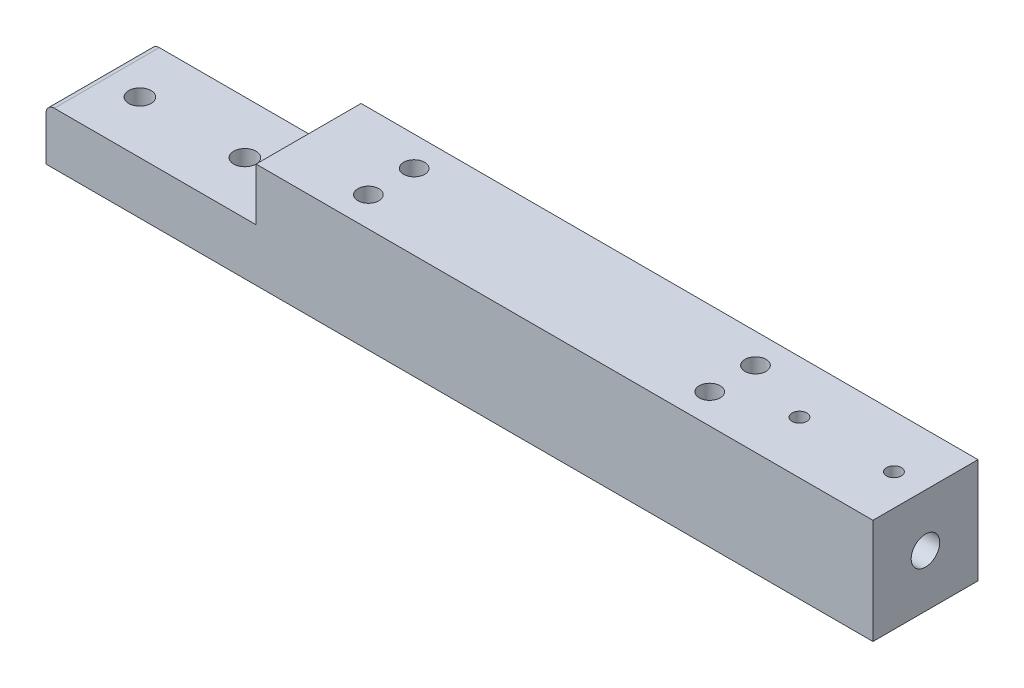
ISO-10303-21;
HEADER;
FILE_DESCRIPTION(('STEP AP214'),'2;1');
FILE_NAME('part.step','',(''),(''),'','','');
FILE_SCHEMA(('AUTOMOTIVE_DESIGN { 1 0 10303 214 1 1 1 1 }'));
ENDSEC;
DATA;
#1=APPLICATION_CONTEXT('core data for automotive mechanical design processes');
#2=APPLICATION_PROTOCOL_DEFINITION('international standard','automotive_design',2000,#1);
#3=PRODUCT_CONTEXT('',#1,'mechanical');
#4=PRODUCT('Part','Part','',(#3));
#5=PRODUCT_RELATED_PRODUCT_CATEGORY('part','',(#4));
#6=PRODUCT_DEFINITION_FORMATION('','',#4);
#7=PRODUCT_DEFINITION_CONTEXT('part definition',#1,'design');
#8=PRODUCT_DEFINITION('design','',#6,#7);
#9=PRODUCT_DEFINITION_SHAPE('','',#8);
#10=(LENGTH_UNIT() NAMED_UNIT(*) SI_UNIT(.MILLI.,.METRE.));
#11=(NAMED_UNIT(*) PLANE_ANGLE_UNIT() SI_UNIT($,.RADIAN.));
#12=(NAMED_UNIT(*) SI_UNIT($,.STERADIAN.) SOLID_ANGLE_UNIT());
#13=UNCERTAINTY_MEASURE_WITH_UNIT(LENGTH_MEASURE(1.E-05),#10,'distance_accuracy_value','');
#14=(GEOMETRIC_REPRESENTATION_CONTEXT(3) GLOBAL_UNCERTAINTY_ASSIGNED_CONTEXT((#13)) GLOBAL_UNIT_ASSIGNED_CONTEXT((#10,
#11,#12)) REPRESENTATION_CONTEXT('',''));
#15=CARTESIAN_POINT('',(0.,0.,0.));
#16=DIRECTION('',(0.,0.,1.));
#17=DIRECTION('',(1.,0.,0.));
#18=AXIS2_PLACEMENT_3D('',#15,#16,#17);
#19=CARTESIAN_POINT('',(0.,6.35000000000002,6.35));
#20=DIRECTION('',(1.,0.,0.));
#21=DIRECTION('',(0.,1.,0.));
#22=AXIS2_PLACEMENT_3D('',#19,#20,#21);
#23=PLANE('',#22);
#24=DIRECTION('',(0.,-1.,0.));
#25=VECTOR('',#24,1.);
#26=CARTESIAN_POINT('',(0.,6.35000000000002,6.35));
#27=LINE('',#26,#25);
#28=CARTESIAN_POINT('',(0.,-1.,6.35));
#29=VERTEX_POINT('',#28);
#30=CARTESIAN_POINT('',(0.,-6.34999999999998,6.35));
#31=VERTEX_POINT('',#30);
#32=EDGE_CURVE('E177',#29,#31,#27,.T.);
#33=ORIENTED_EDGE('',*,*,#32,.F.);
#34=DIRECTION('',(0.,0.,1.));
#35=VECTOR('',#34,1.);
#36=CARTESIAN_POINT('',(0.,-1.,6.35));
#37=LINE('',#36,#35);
#38=CARTESIAN_POINT('',(0.,-1.,-6.35));
#39=VERTEX_POINT('',#38);
#40=EDGE_CURVE('E47',#29,#39,#37,.F.);
#41=ORIENTED_EDGE('',*,*,#40,.T.);
#42=DIRECTION('',(0.,-1.,0.));
#43=VECTOR('',#42,1.);
#44=CARTESIAN_POINT('',(0.,6.35000000000002,-6.35));
#45=LINE('',#44,#43);
#46=CARTESIAN_POINT('',(0.,-6.34999999999998,-6.35));
#47=VERTEX_POINT('',#46);
#48=EDGE_CURVE('E174',#39,#47,#45,.T.);
#49=ORIENTED_EDGE('',*,*,#48,.T.);
#50=DIRECTION('',(0.,0.,-1.));
#51=VECTOR('',#50,1.);
#52=CARTESIAN_POINT('',(0.,-6.34999999999998,6.35));
#53=LINE('',#52,#51);
#54=EDGE_CURVE('E200',#31,#47,#53,.T.);
#55=ORIENTED_EDGE('',*,*,#54,.F.);
#56=EDGE_LOOP('',(#33,#41,#49,#55));
#57=FACE_BOUND('',#56,.T.);
#58=ADVANCED_FACE('F39',(#57),#23,.F.);
#59=CARTESIAN_POINT('',(0.,-6.34999999999998,6.35));
#60=DIRECTION('',(0.,1.,0.));
#61=DIRECTION('',(-1.,0.,0.));
#62=AXIS2_PLACEMENT_3D('',#59,#60,#61);
#63=PLANE('',#62);
#64=CARTESIAN_POINT('',(35.4,-6.34999999999996,-2.7686));
#65=DIRECTION('',(0.,1.,0.));
#66=DIRECTION('',(0.,0.,1.));
#67=AXIS2_PLACEMENT_3D('',#64,#65,#66);
#68=CIRCLE('',#67,1.26999999999999);
#69=CARTESIAN_POINT('',(35.4,-6.34999999999996,-1.4986));
#70=VERTEX_POINT('',#69);
#71=EDGE_CURVE('E122',#70,#70,#68,.T.);
#72=ORIENTED_EDGE('',*,*,#71,.T.);
#73=EDGE_LOOP('',(#72));
#74=FACE_BOUND('',#73,.T.);
#75=CARTESIAN_POINT('',(76.675,-6.34999999999994,-2.7686));
#76=DIRECTION('',(0.,1.,0.));
#77=DIRECTION('',(0.,0.,1.));
#78=AXIS2_PLACEMENT_3D('',#75,#76,#77);
#79=CIRCLE('',#78,1.26999999999999);
#80=CARTESIAN_POINT('',(76.675,-6.34999999999994,-1.49860000000001));
#81=VERTEX_POINT('',#80);
#82=EDGE_CURVE('E128',#81,#81,#79,.T.);
#83=ORIENTED_EDGE('',*,*,#82,.T.);
#84=EDGE_LOOP('',(#83));
#85=FACE_BOUND('',#84,.T.);
#86=CARTESIAN_POINT('',(76.675,-6.34999999999994,2.76859999999999));
#87=DIRECTION('',(0.,1.,0.));
#88=DIRECTION('',(0.,0.,1.));
#89=AXIS2_PLACEMENT_3D('',#86,#87,#88);
#90=CIRCLE('',#89,1.26999999999999);
#91=CARTESIAN_POINT('',(76.675,-6.34999999999994,4.03859999999998));
#92=VERTEX_POINT('',#91);
#93=EDGE_CURVE('E134',#92,#92,#90,.T.);
#94=ORIENTED_EDGE('',*,*,#93,.T.);
#95=EDGE_LOOP('',(#94));
#96=FACE_BOUND('',#95,.T.);
#97=CARTESIAN_POINT('',(35.4,-6.34999999999996,2.76859999999999));
#98=DIRECTION('',(0.,1.,0.));
#99=DIRECTION('',(0.,0.,1.));
#100=AXIS2_PLACEMENT_3D('',#97,#98,#99);
#101=CIRCLE('',#100,1.26999999999999);
#102=CARTESIAN_POINT('',(35.4,-6.34999999999996,4.03859999999998));
#103=VERTEX_POINT('',#102);
#104=EDGE_CURVE('E140',#103,#103,#101,.T.);
#105=ORIENTED_EDGE('',*,*,#104,.T.);
#106=EDGE_LOOP('',(#105));
#107=FACE_BOUND('',#106,.T.);
#108=CARTESIAN_POINT('',(17.7000000000005,-6.34999999999998,-5.11919416561077E-13));
#109=DIRECTION('',(0.,1.,0.));
#110=DIRECTION('',(0.,0.,1.));
#111=AXIS2_PLACEMENT_3D('',#108,#109,#110);
#112=CIRCLE('',#111,1.35255);
#113=CARTESIAN_POINT('',(17.7000000000005,-6.34999999999998,1.35254999999949));
#114=VERTEX_POINT('',#113);
#115=EDGE_CURVE('E152',#114,#114,#112,.T.);
#116=ORIENTED_EDGE('',*,*,#115,.T.);
#117=EDGE_LOOP('',(#116));
#118=FACE_BOUND('',#117,.T.);
#119=CARTESIAN_POINT('',(5.00000000000052,-6.34999999999998,-5.11919416561077E-13));
#120=DIRECTION('',(0.,1.,0.));
#121=DIRECTION('',(0.,0.,1.));
#122=AXIS2_PLACEMENT_3D('',#119,#120,#121);
#123=CIRCLE('',#122,1.35255);
#124=CARTESIAN_POINT('',(5.00000000000052,-6.34999999999998,1.35254999999949));
#125=VERTEX_POINT('',#124);
#126=EDGE_CURVE('E158',#125,#125,#123,.T.);
#127=ORIENTED_EDGE('',*,*,#126,.T.);
#128=EDGE_LOOP('',(#127));
#129=FACE_BOUND('',#128,.T.);
#130=DIRECTION('',(1.,0.,0.));
#131=VECTOR('',#130,1.);
#132=CARTESIAN_POINT('',(0.,-6.34999999999998,-6.35));
#133=LINE('',#132,#131);
#134=CARTESIAN_POINT('',(100.,-6.35,-6.35));
#135=VERTEX_POINT('',#134);
#136=EDGE_CURVE('E189',#47,#135,#133,.T.);
#137=ORIENTED_EDGE('',*,*,#136,.T.);
#138=DIRECTION('',(0.,0.,-1.));
#139=VECTOR('',#138,1.);
#140=CARTESIAN_POINT('',(100.,-6.35,6.35));
#141=LINE('',#140,#139);
#142=CARTESIAN_POINT('',(100.,-6.35,6.35));
#143=VERTEX_POINT('',#142);
#144=EDGE_CURVE('E197',#143,#135,#141,.T.);
#145=ORIENTED_EDGE('',*,*,#144,.F.);
#146=DIRECTION('',(1.,0.,0.));
#147=VECTOR('',#146,1.);
#148=CARTESIAN_POINT('',(0.,-6.34999999999998,6.35));
#149=LINE('',#148,#147);
#150=EDGE_CURVE('E179',#31,#143,#149,.T.);
#151=ORIENTED_EDGE('',*,*,#150,.F.);
#152=ORIENTED_EDGE('',*,*,#54,.T.);
#153=EDGE_LOOP('',(#137,#145,#151,#152));
#154=FACE_BOUND('',#153,.T.);
#155=ADVANCED_FACE('F243',(#74,#85,#96,#107,#118,#129,#154),#63,.F.);
#156=CARTESIAN_POINT('',(100.,6.35000000000006,6.35));
#157=DIRECTION('',(-1.,0.,0.));
#158=DIRECTION('',(0.,0.,1.));
#159=AXIS2_PLACEMENT_3D('',#156,#157,#158);
#160=PLANE('',#159);
#161=CARTESIAN_POINT('',(100.,0.,0.));
#162=DIRECTION('',(1.,0.,0.));
#163=DIRECTION('',(0.,0.,-1.));
#164=AXIS2_PLACEMENT_3D('',#161,#162,#163);
#165=CIRCLE('',#164,1.7272);
#166=CARTESIAN_POINT('',(100.,0.,-1.7272));
#167=VERTEX_POINT('',#166);
#168=EDGE_CURVE('E143',#167,#167,#165,.T.);
#169=ORIENTED_EDGE('',*,*,#168,.F.);
#170=EDGE_LOOP('',(#169));
#171=FACE_BOUND('',#170,.T.);
#172=DIRECTION('',(0.,1.,0.));
#173=VECTOR('',#172,1.);
#174=CARTESIAN_POINT('',(100.,6.35000000000006,-6.35));
#175=LINE('',#174,#173);
#176=CARTESIAN_POINT('',(100.,6.35000000000006,-6.35));
#177=VERTEX_POINT('',#176);
#178=EDGE_CURVE('E191',#135,#177,#175,.T.);
#179=ORIENTED_EDGE('',*,*,#178,.T.);
#180=DIRECTION('',(0.,0.,-1.));
#181=VECTOR('',#180,1.);
#182=CARTESIAN_POINT('',(100.,6.35000000000006,6.35));
#183=LINE('',#182,#181);
#184=CARTESIAN_POINT('',(100.,6.35000000000006,6.35));
#185=VERTEX_POINT('',#184);
#186=EDGE_CURVE('E187',#185,#177,#183,.T.);
#187=ORIENTED_EDGE('',*,*,#186,.F.);
#188=DIRECTION('',(0.,1.,0.));
#189=VECTOR('',#188,1.);
#190=CARTESIAN_POINT('',(100.,6.35000000000006,6.35));
#191=LINE('',#190,#189);
#192=EDGE_CURVE('E182',#143,#185,#191,.T.);
#193=ORIENTED_EDGE('',*,*,#192,.F.);
#194=ORIENTED_EDGE('',*,*,#144,.T.);
#195=EDGE_LOOP('',(#179,#187,#193,#194));
#196=FACE_BOUND('',#195,.T.);
#197=ADVANCED_FACE('F247',(#171,#196),#160,.F.);
#198=CARTESIAN_POINT('',(0.,6.35000000000002,6.35));
#199=DIRECTION('',(0.,-1.,0.));
#200=DIRECTION('',(1.,0.,0.));
#201=AXIS2_PLACEMENT_3D('',#198,#199,#200);
#202=PLANE('',#201);
#203=CARTESIAN_POINT('',(84.76,6.35000000000006,0.));
#204=DIRECTION('',(0.,1.,0.));
#205=DIRECTION('',(0.,0.,1.));
#206=AXIS2_PLACEMENT_3D('',#203,#204,#205);
#207=CIRCLE('',#206,0.888999999999987);
#208=CARTESIAN_POINT('',(84.76,6.35000000000006,0.888999999999987));
#209=VERTEX_POINT('',#208);
#210=EDGE_CURVE('E111',#209,#209,#207,.T.);
#211=ORIENTED_EDGE('',*,*,#210,.F.);
#212=EDGE_LOOP('',(#211));
#213=FACE_BOUND('',#212,.T.);
#214=CARTESIAN_POINT('',(96.19,6.35000000000006,0.));
#215=DIRECTION('',(0.,1.,0.));
#216=DIRECTION('',(0.,0.,1.));
#217=AXIS2_PLACEMENT_3D('',#214,#215,#216);
#218=CIRCLE('',#217,0.888999999999987);
#219=CARTESIAN_POINT('',(96.19,6.35000000000006,0.888999999999987));
#220=VERTEX_POINT('',#219);
#221=EDGE_CURVE('E110',#220,#220,#218,.T.);
#222=ORIENTED_EDGE('',*,*,#221,.F.);
#223=EDGE_LOOP('',(#222));
#224=FACE_BOUND('',#223,.T.);
#225=CARTESIAN_POINT('',(35.4,6.35000000000004,-2.7686));
#226=DIRECTION('',(0.,1.,0.));
#227=DIRECTION('',(0.,0.,1.));
#228=AXIS2_PLACEMENT_3D('',#225,#226,#227);
#229=CIRCLE('',#228,1.27);
#230=CARTESIAN_POINT('',(35.4,6.35000000000004,-1.4986));
#231=VERTEX_POINT('',#230);
#232=EDGE_CURVE('E119',#231,#231,#229,.T.);
#233=ORIENTED_EDGE('',*,*,#232,.F.);
#234=EDGE_LOOP('',(#233));
#235=FACE_BOUND('',#234,.T.);
#236=CARTESIAN_POINT('',(76.675,6.35000000000006,-2.7686));
#237=DIRECTION('',(0.,1.,0.));
#238=DIRECTION('',(0.,0.,1.));
#239=AXIS2_PLACEMENT_3D('',#236,#237,#238);
#240=CIRCLE('',#239,1.26999999999999);
#241=CARTESIAN_POINT('',(76.675,6.35000000000006,-1.49860000000001));
#242=VERTEX_POINT('',#241);
#243=EDGE_CURVE('E125',#242,#242,#240,.T.);
#244=ORIENTED_EDGE('',*,*,#243,.F.);
#245=EDGE_LOOP('',(#244));
#246=FACE_BOUND('',#245,.T.);
#247=CARTESIAN_POINT('',(76.675,6.35000000000006,2.76859999999999));
#248=DIRECTION('',(0.,1.,0.));
#249=DIRECTION('',(0.,0.,1.));
#250=AXIS2_PLACEMENT_3D('',#247,#248,#249);
#251=CIRCLE('',#250,1.26999999999999);
#252=CARTESIAN_POINT('',(76.675,6.35000000000006,4.03859999999998));
#253=VERTEX_POINT('',#252);
#254=EDGE_CURVE('E131',#253,#253,#251,.T.);
#255=ORIENTED_EDGE('',*,*,#254,.F.);
#256=EDGE_LOOP('',(#255));
#257=FACE_BOUND('',#256,.T.);
#258=CARTESIAN_POINT('',(35.4,6.35000000000004,2.76859999999999));
#259=DIRECTION('',(0.,1.,0.));
#260=DIRECTION('',(0.,0.,1.));
#261=AXIS2_PLACEMENT_3D('',#258,#259,#260);
#262=CIRCLE('',#261,1.27);
#263=CARTESIAN_POINT('',(35.4,6.35000000000004,4.03859999999999));
#264=VERTEX_POINT('',#263);
#265=EDGE_CURVE('E137',#264,#264,#262,.T.);
#266=ORIENTED_EDGE('',*,*,#265,.F.);
#267=EDGE_LOOP('',(#266));
#268=FACE_BOUND('',#267,.T.);
#269=DIRECTION('',(-1.,0.,0.));
#270=VECTOR('',#269,1.);
#271=CARTESIAN_POINT('',(0.,6.35000000000002,-6.35));
#272=LINE('',#271,#270);
#273=CARTESIAN_POINT('',(25.4,6.35000000000002,-6.35));
#274=VERTEX_POINT('',#273);
#275=EDGE_CURVE('E180',#177,#274,#272,.T.);
#276=ORIENTED_EDGE('',*,*,#275,.T.);
#277=DIRECTION('',(0.,0.,1.));
#278=VECTOR('',#277,1.);
#279=CARTESIAN_POINT('',(25.4,6.35000000000002,-6.35));
#280=LINE('',#279,#278);
#281=CARTESIAN_POINT('',(25.4,6.35000000000002,6.35));
#282=VERTEX_POINT('',#281);
#283=EDGE_CURVE('E171',#274,#282,#280,.T.);
#284=ORIENTED_EDGE('',*,*,#283,.T.);
#285=DIRECTION('',(-1.,0.,0.));
#286=VECTOR('',#285,1.);
#287=CARTESIAN_POINT('',(0.,6.35000000000002,6.35));
#288=LINE('',#287,#286);
#289=EDGE_CURVE('E184',#185,#282,#288,.T.);
#290=ORIENTED_EDGE('',*,*,#289,.F.);
#291=ORIENTED_EDGE('',*,*,#186,.T.);
#292=EDGE_LOOP('',(#276,#284,#290,#291));
#293=FACE_BOUND('',#292,.T.);
#294=ADVANCED_FACE('F253',(#213,#224,#235,#246,#257,#268,#293),#202,.F.);
#295=CARTESIAN_POINT('',(0.,-6.34999999999998,6.35));
#296=DIRECTION('',(0.,0.,1.));
#297=DIRECTION('',(1.,0.,0.));
#298=AXIS2_PLACEMENT_3D('',#295,#296,#297);
#299=PLANE('',#298);
#300=DIRECTION('',(1.,0.,0.));
#301=VECTOR('',#300,1.);
#302=CARTESIAN_POINT('',(0.,0.,6.35));
#303=LINE('',#302,#301);
#304=CARTESIAN_POINT('',(0.999999999999997,0.,6.35));
#305=VERTEX_POINT('',#304);
#306=CARTESIAN_POINT('',(25.4,0.,6.35));
#307=VERTEX_POINT('',#306);
#308=EDGE_CURVE('E161',#305,#307,#303,.T.);
#309=ORIENTED_EDGE('',*,*,#308,.F.);
#310=CARTESIAN_POINT('',(0.999999999999997,-1.,6.35));
#311=DIRECTION('',(0.,0.,1.));
#312=DIRECTION('',(1.,0.,0.));
#313=AXIS2_PLACEMENT_3D('',#310,#311,#312);
#314=CIRCLE('',#313,1.);
#315=EDGE_CURVE('E61',#305,#29,#314,.T.);
#316=ORIENTED_EDGE('',*,*,#315,.T.);
#317=ORIENTED_EDGE('',*,*,#32,.T.);
#318=ORIENTED_EDGE('',*,*,#150,.T.);
#319=ORIENTED_EDGE('',*,*,#192,.T.);
#320=ORIENTED_EDGE('',*,*,#289,.T.);
#321=DIRECTION('',(0.,1.,0.));
#322=VECTOR('',#321,1.);
#323=CARTESIAN_POINT('',(25.4,6.35000000000002,6.35));
#324=LINE('',#323,#322);
#325=EDGE_CURVE('E165',#307,#282,#324,.T.);
#326=ORIENTED_EDGE('',*,*,#325,.F.);
#327=EDGE_LOOP('',(#309,#316,#317,#318,#319,#320,#326));
#328=FACE_BOUND('',#327,.T.);
#329=ADVANCED_FACE('F257',(#328),#299,.T.);
#330=CARTESIAN_POINT('',(0.,-6.34999999999998,-6.35));
#331=DIRECTION('',(0.,0.,1.));
#332=DIRECTION('',(1.,0.,0.));
#333=AXIS2_PLACEMENT_3D('',#330,#331,#332);
#334=PLANE('',#333);
#335=ORIENTED_EDGE('',*,*,#48,.F.);
#336=CARTESIAN_POINT('',(0.999999999999997,-1.,-6.35));
#337=DIRECTION('',(0.,0.,1.));
#338=DIRECTION('',(1.,0.,0.));
#339=AXIS2_PLACEMENT_3D('',#336,#337,#338);
#340=CIRCLE('',#339,1.);
#341=CARTESIAN_POINT('',(0.999999999999997,0.,-6.35));
#342=VERTEX_POINT('',#341);
#343=EDGE_CURVE('E11',#39,#342,#340,.F.);
#344=ORIENTED_EDGE('',*,*,#343,.T.);
#345=DIRECTION('',(1.,0.,0.));
#346=VECTOR('',#345,1.);
#347=CARTESIAN_POINT('',(0.,0.,-6.35));
#348=LINE('',#347,#346);
#349=CARTESIAN_POINT('',(25.4,0.,-6.35));
#350=VERTEX_POINT('',#349);
#351=EDGE_CURVE('E162',#342,#350,#348,.T.);
#352=ORIENTED_EDGE('',*,*,#351,.T.);
#353=DIRECTION('',(0.,1.,0.));
#354=VECTOR('',#353,1.);
#355=CARTESIAN_POINT('',(25.4,6.35000000000002,-6.35));
#356=LINE('',#355,#354);
#357=EDGE_CURVE('E164',#350,#274,#356,.T.);
#358=ORIENTED_EDGE('',*,*,#357,.T.);
#359=ORIENTED_EDGE('',*,*,#275,.F.);
#360=ORIENTED_EDGE('',*,*,#178,.F.);
#361=ORIENTED_EDGE('',*,*,#136,.F.);
#362=EDGE_LOOP('',(#335,#344,#352,#358,#359,#360,#361));
#363=FACE_BOUND('',#362,.T.);
#364=ADVANCED_FACE('F259',(#363),#334,.F.);
#365=CARTESIAN_POINT('',(25.4,6.35000000000002,-6.35));
#366=DIRECTION('',(1.,0.,0.));
#367=DIRECTION('',(0.,0.,-1.));
#368=AXIS2_PLACEMENT_3D('',#365,#366,#367);
#369=PLANE('',#368);
#370=ORIENTED_EDGE('',*,*,#325,.T.);
#371=ORIENTED_EDGE('',*,*,#283,.F.);
#372=ORIENTED_EDGE('',*,*,#357,.F.);
#373=DIRECTION('',(0.,0.,1.));
#374=VECTOR('',#373,1.);
#375=CARTESIAN_POINT('',(25.4,0.,-6.35));
#376=LINE('',#375,#374);
#377=EDGE_CURVE('E168',#350,#307,#376,.T.);
#378=ORIENTED_EDGE('',*,*,#377,.T.);
#379=EDGE_LOOP('',(#370,#371,#372,#378));
#380=FACE_BOUND('',#379,.T.);
#381=ADVANCED_FACE('F262',(#380),#369,.F.);
#382=CARTESIAN_POINT('',(0.,0.,-6.35));
#383=DIRECTION('',(0.,-1.,0.));
#384=DIRECTION('',(1.,0.,0.));
#385=AXIS2_PLACEMENT_3D('',#382,#383,#384);
#386=PLANE('',#385);
#387=CARTESIAN_POINT('',(17.7000000000005,0.,-5.11919416561077E-13));
#388=DIRECTION('',(0.,1.,0.));
#389=DIRECTION('',(0.,0.,1.));
#390=AXIS2_PLACEMENT_3D('',#387,#388,#389);
#391=CIRCLE('',#390,1.35254999999999);
#392=CARTESIAN_POINT('',(17.7000000000005,0.,1.35254999999948));
#393=VERTEX_POINT('',#392);
#394=EDGE_CURVE('E149',#393,#393,#391,.T.);
#395=ORIENTED_EDGE('',*,*,#394,.F.);
#396=EDGE_LOOP('',(#395));
#397=FACE_BOUND('',#396,.T.);
#398=CARTESIAN_POINT('',(5.00000000000052,0.,-5.11919416561077E-13));
#399=DIRECTION('',(0.,1.,0.));
#400=DIRECTION('',(0.,0.,1.));
#401=AXIS2_PLACEMENT_3D('',#398,#399,#400);
#402=CIRCLE('',#401,1.35254999999999);
#403=CARTESIAN_POINT('',(5.00000000000052,0.,1.35254999999948));
#404=VERTEX_POINT('',#403);
#405=EDGE_CURVE('E155',#404,#404,#402,.T.);
#406=ORIENTED_EDGE('',*,*,#405,.F.);
#407=EDGE_LOOP('',(#406));
#408=FACE_BOUND('',#407,.T.);
#409=ORIENTED_EDGE('',*,*,#351,.F.);
#410=DIRECTION('',(0.,0.,1.));
#411=VECTOR('',#410,1.);
#412=CARTESIAN_POINT('',(0.999999999999997,0.,-6.35));
#413=LINE('',#412,#411);
#414=EDGE_CURVE('E203',#342,#305,#413,.T.);
#415=ORIENTED_EDGE('',*,*,#414,.T.);
#416=ORIENTED_EDGE('',*,*,#308,.T.);
#417=ORIENTED_EDGE('',*,*,#377,.F.);
#418=EDGE_LOOP('',(#409,#415,#416,#417));
#419=FACE_BOUND('',#418,.T.);
#420=ADVANCED_FACE('F266',(#397,#408,#419),#386,.F.);
#421=CARTESIAN_POINT('',(5.00000000000052,0.,-5.11919416561077E-13));
#422=DIRECTION('',(0.,1.,0.));
#423=DIRECTION('',(0.,0.,1.));
#424=AXIS2_PLACEMENT_3D('',#421,#422,#423);
#425=CYLINDRICAL_SURFACE('',#424,1.35254999999999);
#426=ORIENTED_EDGE('',*,*,#126,.F.);
#427=EDGE_LOOP('',(#426));
#428=FACE_BOUND('',#427,.T.);
#429=ORIENTED_EDGE('',*,*,#405,.T.);
#430=EDGE_LOOP('',(#429));
#431=FACE_BOUND('',#430,.T.);
#432=ADVANCED_FACE('F269',(#428,#431),#425,.F.);
#433=CARTESIAN_POINT('',(17.7000000000005,0.,-5.11919416561077E-13));
#434=DIRECTION('',(0.,1.,0.));
#435=DIRECTION('',(0.,0.,1.));
#436=AXIS2_PLACEMENT_3D('',#433,#434,#435);
#437=CYLINDRICAL_SURFACE('',#436,1.35254999999999);
#438=ORIENTED_EDGE('',*,*,#115,.F.);
#439=EDGE_LOOP('',(#438));
#440=FACE_BOUND('',#439,.T.);
#441=ORIENTED_EDGE('',*,*,#394,.T.);
#442=EDGE_LOOP('',(#441));
#443=FACE_BOUND('',#442,.T.);
#444=ADVANCED_FACE('F276',(#440,#443),#437,.F.);
#445=CARTESIAN_POINT('',(90.,0.,0.));
#446=DIRECTION('',(1.,0.,0.));
#447=DIRECTION('',(0.,0.,-1.));
#448=AXIS2_PLACEMENT_3D('',#445,#446,#447);
#449=CONICAL_SURFACE('',#448,1.7272,1.02974425867665);
#450=CARTESIAN_POINT('',(88.9621935388156,0.,0.));
#451=VERTEX_POINT('',#450);
#452=VERTEX_LOOP('',#451);
#453=FACE_BOUND('',#452,.T.);
#454=CARTESIAN_POINT('',(90.,0.,0.));
#455=DIRECTION('',(1.,0.,0.));
#456=DIRECTION('',(0.,0.,-1.));
#457=AXIS2_PLACEMENT_3D('',#454,#455,#456);
#458=CIRCLE('',#457,1.7272);
#459=CARTESIAN_POINT('',(90.,0.,-1.7272));
#460=VERTEX_POINT('',#459);
#461=EDGE_CURVE('E146',#460,#460,#458,.T.);
#462=ORIENTED_EDGE('',*,*,#461,.T.);
#463=EDGE_LOOP('',(#462));
#464=FACE_BOUND('',#463,.T.);
#465=ADVANCED_FACE('F238',(#453,#464),#449,.F.);
#466=CARTESIAN_POINT('',(100.,0.,0.));
#467=DIRECTION('',(1.,0.,0.));
#468=DIRECTION('',(0.,0.,-1.));
#469=AXIS2_PLACEMENT_3D('',#466,#467,#468);
#470=CYLINDRICAL_SURFACE('',#469,1.7272);
#471=CARTESIAN_POINT('',(96.19,1.48084396207032,0.888999999999994));
#472=CARTESIAN_POINT('',(96.2361083535032,1.48084832745726,0.888996615264809));
#473=CARTESIAN_POINT('',(96.2822700180821,1.48303058217222,0.885388613992067));
#474=CARTESIAN_POINT('',(96.3731590282946,1.49143684404558,0.871148568158528));
#475=CARTESIAN_POINT('',(96.4178833552682,1.49766883967234,0.860502639950182));
#476=CARTESIAN_POINT('',(96.504409046111,1.51325732830116,0.832779087205355));
#477=CARTESIAN_POINT('',(96.5462251769757,1.5225963907492,0.815737276558255));
#478=CARTESIAN_POINT('',(96.6263933374121,1.54331937386705,0.775815390304991));
#479=CARTESIAN_POINT('',(96.6647450075166,1.55470350636493,0.752934709806195));
#480=CARTESIAN_POINT('',(96.7406056127217,1.57945187802226,0.69963378151837));
#481=CARTESIAN_POINT('',(96.777745682501,1.59290221390746,0.668728303246308));
#482=CARTESIAN_POINT('',(96.8466048691556,1.61957403584244,0.601262132082391));
#483=CARTESIAN_POINT('',(96.8783211398649,1.63279539848694,0.564698489092826));
#484=CARTESIAN_POINT('',(96.9376866329153,1.6586647777142,0.483718272862817));
#485=CARTESIAN_POINT('',(96.9648744058367,1.67120176647289,0.438924585233066));
#486=CARTESIAN_POINT('',(97.0111588927517,1.69315815067375,0.344632506896398));
#487=CARTESIAN_POINT('',(97.0302610124157,1.70257962806886,0.295137286594164));
#488=CARTESIAN_POINT('',(97.0583452131254,1.71662051813202,0.196761604183901));
#489=CARTESIAN_POINT('',(97.0679763627981,1.72154592905832,0.148111121361051));
#490=CARTESIAN_POINT('',(97.0789906373088,1.72718829405338,0.0496554725691075));
#491=CARTESIAN_POINT('',(97.0803790992113,1.72790797129125,-0.000148925270776731));
#492=CARTESIAN_POINT('',(97.075100978816,1.72519562062309,-0.09458572976086));
#493=CARTESIAN_POINT('',(97.069163867983,1.7221395403535,-0.139272333601822));
#494=CARTESIAN_POINT('',(97.0507195487727,1.71279709137995,-0.226910265898543));
#495=CARTESIAN_POINT('',(97.0382118459242,1.70651047956255,-0.269861463493987));
#496=CARTESIAN_POINT('',(97.006920959783,1.69117440939173,-0.353530159649473));
#497=CARTESIAN_POINT('',(96.9880575938448,1.6820897840451,-0.394210957937817));
#498=CARTESIAN_POINT('',(96.9447125106327,1.6619631996405,-0.471923560510329));
#499=CARTESIAN_POINT('',(96.9202288285902,1.65092055640011,-0.508954082232502));
#500=CARTESIAN_POINT('',(96.8635721557014,1.62661612471202,-0.582213064331932));
#501=CARTESIAN_POINT('',(96.8308790787606,1.61324288541739,-0.618002574873134));
#502=CARTESIAN_POINT('',(96.7601134216645,1.58645994437134,-0.683835037067926));
#503=CARTESIAN_POINT('',(96.722036322307,1.57305022136614,-0.713873110743259));
#504=CARTESIAN_POINT('',(96.6383261999496,1.54667717380076,-0.769428866710376));
#505=CARTESIAN_POINT('',(96.5923503525433,1.53381131649519,-0.794481014514657));
#506=CARTESIAN_POINT('',(96.4960315713619,1.51141450158111,-0.836309917641537));
#507=CARTESIAN_POINT('',(96.445693466137,1.5018799140014,-0.853095688775464));
#508=CARTESIAN_POINT('',(96.3463177586785,1.48832591112981,-0.876513887395255));
#509=CARTESIAN_POINT('',(96.2975013622825,1.4839244907497,-0.883854546520912));
#510=CARTESIAN_POINT('',(96.1991488349013,1.48005975610891,-0.890314763067776));
#511=CARTESIAN_POINT('',(96.149613319822,1.48059243936226,-0.889440983934658));
#512=CARTESIAN_POINT('',(96.0575430984338,1.48612951251797,-0.88014715900833));
#513=CARTESIAN_POINT('',(96.0148780593813,1.49059298959945,-0.872639577423416));
#514=CARTESIAN_POINT('',(95.9315049731275,1.50266928330699,-0.851674873623385));
#515=CARTESIAN_POINT('',(95.8907976171954,1.51028320338998,-0.838215666710998));
#516=CARTESIAN_POINT('',(95.810364530265,1.52820536683135,-0.805094128236195));
#517=CARTESIAN_POINT('',(95.7707689238391,1.53862094424359,-0.785176161804063));
#518=CARTESIAN_POINT('',(95.6952492859059,1.56088838315847,-0.739920979091516));
#519=CARTESIAN_POINT('',(95.6593271593513,1.5727409829634,-0.714580971959747));
#520=CARTESIAN_POINT('',(95.5870917010865,1.59847061843336,-0.655204645660767));
#521=CARTESIAN_POINT('',(95.5513815820922,1.6124047692974,-0.620455878762687));
#522=CARTESIAN_POINT('',(95.4860948399172,1.63935858598341,-0.545268978509849));
#523=CARTESIAN_POINT('',(95.4565206946453,1.65237788095825,-0.504828557698724));
#524=CARTESIAN_POINT('',(95.4034997860409,1.67657578116295,-0.417640296136884));
#525=CARTESIAN_POINT('',(95.3802844619004,1.68768045793914,-0.370729695213985));
#526=CARTESIAN_POINT('',(95.3423131858349,1.70622259340807,-0.272932836113844));
#527=CARTESIAN_POINT('',(95.3275493816442,1.71366345523128,-0.222050318346658));
#528=CARTESIAN_POINT('',(95.3082408323263,1.72346648378786,-0.122973339354585));
#529=CARTESIAN_POINT('',(95.3028580567189,1.72624420175097,-0.0749831638013421));
#530=CARTESIAN_POINT('',(95.2999528432205,1.72773849336027,0.0212904764953951));
#531=CARTESIAN_POINT('',(95.3024273011103,1.72645667084171,0.0695738178924753));
#532=CARTESIAN_POINT('',(95.3146318370492,1.72021642260968,0.161370245033847));
#533=CARTESIAN_POINT('',(95.3238235699824,1.71553093631586,0.204975587845638));
#534=CARTESIAN_POINT('',(95.3484472406251,1.70323117070779,0.289943613595778));
#535=CARTESIAN_POINT('',(95.3638800246375,1.69561649419452,0.331305991519193));
#536=CARTESIAN_POINT('',(95.4011879835485,1.67774981950203,0.412523252972158));
#537=CARTESIAN_POINT('',(95.423300613543,1.66740277933404,0.452247498634208));
#538=CARTESIAN_POINT('',(95.4730467799148,1.64512200059503,0.527578478285216));
#539=CARTESIAN_POINT('',(95.5006828078974,1.63318754675722,0.563183342534721));
#540=CARTESIAN_POINT('',(95.5640288460884,1.60742510965883,0.63319559822695));
#541=CARTESIAN_POINT('',(95.6002808106172,1.59352958384933,0.667088981421453));
#542=CARTESIAN_POINT('',(95.6781039741345,1.56639944154534,0.728521250488726));
#543=CARTESIAN_POINT('',(95.7196803152362,1.55316548137823,0.756053920346182));
#544=CARTESIAN_POINT('',(95.8091719780267,1.5283998490245,0.804982847166558));
#545=CARTESIAN_POINT('',(95.8572772589182,1.51696017016231,0.826081369627132));
#546=CARTESIAN_POINT('',(95.9571146385769,1.498252543193,0.859555480233888));
#547=CARTESIAN_POINT('',(96.0088340453881,1.49097074583165,0.871960058331314));
#548=CARTESIAN_POINT('',(96.0826412744966,1.48457750126744,0.882756549173943));
#549=CARTESIAN_POINT('',(96.1040174263625,1.48318314480169,0.885093692950632));
#550=CARTESIAN_POINT('',(96.1469251662011,1.48131532578066,0.888216258968132));
#551=CARTESIAN_POINT('',(96.1684567640772,1.48084192242775,0.88900158145201));
#552=CARTESIAN_POINT('',(96.19,1.48084396207032,0.888999999999994));
#553=B_SPLINE_CURVE_WITH_KNOTS('',3,(#471,#472,#473,#474,#475,#476,#477,#478,#479,#480,#481,
#482,#483,#484,#485,#486,#487,#488,#489,#490,#491,#492,#493,#494,#495,#496,#497,#498,#499,#500,
#501,#502,#503,#504,#505,#506,#507,#508,#509,#510,#511,#512,#513,#514,#515,#516,#517,#518,#519,
#520,#521,#522,#523,#524,#525,#526,#527,#528,#529,#530,#531,#532,#533,#534,#535,#536,#537,#538,
#539,#540,#541,#542,#543,#544,#545,#546,#547,#548,#549,#550,#551,#552),.UNSPECIFIED.,.T.,.F.,(4,
2,2,2,2,2,2,2,2,2,2,2,2,2,2,2,2,2,2,2,2,2,2,2,2,2,2,2,2,2,2,2,2,2,2,2,2,2,2,2,4),(0.,
0.138234255339592,0.276742020982976,0.414485508423581,0.552243271549689,0.702082092855361,
0.851999303155163,1.01278343107387,1.17345989619864,1.32214061089729,1.47072504569364,
1.60563667699592,1.74055846255169,1.87725045251443,2.01399030068259,2.16421029064905,
2.31455712807219,2.47546131038961,2.63618961003245,2.78398654040135,2.93166359017067,
3.06172736608875,3.19183673604669,3.3278989467125,3.46403136098565,3.61856130672923,
3.77315353582552,3.93279038999451,4.09227868461135,4.236605625614,4.38087555332797,
4.51469905544809,4.64854071047352,4.78785073896008,4.92722375263023,5.08116218710913,
5.23525042769867,5.39565370056544,5.55551953088928,5.62010266018666,5.68468994099643),.UNSPECIFIED.);
#554=CARTESIAN_POINT('',(96.19,1.48084396207032,0.888999999999994));
#555=VERTEX_POINT('',#554);
#556=EDGE_CURVE('E114',#555,#555,#553,.T.);
#557=ORIENTED_EDGE('',*,*,#556,.T.);
#558=EDGE_LOOP('',(#557));
#559=FACE_BOUND('',#558,.T.);
#560=ORIENTED_EDGE('',*,*,#461,.F.);
#561=EDGE_LOOP('',(#560));
#562=FACE_BOUND('',#561,.T.);
#563=ORIENTED_EDGE('',*,*,#168,.T.);
#564=EDGE_LOOP('',(#563));
#565=FACE_BOUND('',#564,.T.);
#566=ADVANCED_FACE('F212',(#559,#562,#565),#470,.F.);
#567=CARTESIAN_POINT('',(35.4,6.35000000000004,2.76859999999999));
#568=DIRECTION('',(0.,1.,0.));
#569=DIRECTION('',(0.,0.,1.));
#570=AXIS2_PLACEMENT_3D('',#567,#568,#569);
#571=CYLINDRICAL_SURFACE('',#570,1.27);
#572=ORIENTED_EDGE('',*,*,#104,.F.);
#573=EDGE_LOOP('',(#572));
#574=FACE_BOUND('',#573,.T.);
#575=ORIENTED_EDGE('',*,*,#265,.T.);
#576=EDGE_LOOP('',(#575));
#577=FACE_BOUND('',#576,.T.);
#578=ADVANCED_FACE('F231',(#574,#577),#571,.F.);
#579=CARTESIAN_POINT('',(76.675,6.35000000000006,2.76859999999999));
#580=DIRECTION('',(0.,1.,0.));
#581=DIRECTION('',(0.,0.,1.));
#582=AXIS2_PLACEMENT_3D('',#579,#580,#581);
#583=CYLINDRICAL_SURFACE('',#582,1.26999999999999);
#584=ORIENTED_EDGE('',*,*,#93,.F.);
#585=EDGE_LOOP('',(#584));
#586=FACE_BOUND('',#585,.T.);
#587=ORIENTED_EDGE('',*,*,#254,.T.);
#588=EDGE_LOOP('',(#587));
#589=FACE_BOUND('',#588,.T.);
#590=ADVANCED_FACE('F228',(#586,#589),#583,.F.);
#591=CARTESIAN_POINT('',(76.675,6.35000000000006,-2.7686));
#592=DIRECTION('',(0.,1.,0.));
#593=DIRECTION('',(0.,0.,1.));
#594=AXIS2_PLACEMENT_3D('',#591,#592,#593);
#595=CYLINDRICAL_SURFACE('',#594,1.26999999999999);
#596=ORIENTED_EDGE('',*,*,#82,.F.);
#597=EDGE_LOOP('',(#596));
#598=FACE_BOUND('',#597,.T.);
#599=ORIENTED_EDGE('',*,*,#243,.T.);
#600=EDGE_LOOP('',(#599));
#601=FACE_BOUND('',#600,.T.);
#602=ADVANCED_FACE('F224',(#598,#601),#595,.F.);
#603=CARTESIAN_POINT('',(35.4,6.35000000000004,-2.7686));
#604=DIRECTION('',(0.,1.,0.));
#605=DIRECTION('',(0.,0.,1.));
#606=AXIS2_PLACEMENT_3D('',#603,#604,#605);
#607=CYLINDRICAL_SURFACE('',#606,1.27);
#608=ORIENTED_EDGE('',*,*,#71,.F.);
#609=EDGE_LOOP('',(#608));
#610=FACE_BOUND('',#609,.T.);
#611=ORIENTED_EDGE('',*,*,#232,.T.);
#612=EDGE_LOOP('',(#611));
#613=FACE_BOUND('',#612,.T.);
#614=ADVANCED_FACE('F219',(#610,#613),#607,.F.);
#615=CARTESIAN_POINT('',(96.19,6.35000000000006,0.));
#616=DIRECTION('',(0.,1.,0.));
#617=DIRECTION('',(0.,0.,1.));
#618=AXIS2_PLACEMENT_3D('',#615,#616,#617);
#619=CYLINDRICAL_SURFACE('',#618,0.888999999999994);
#620=ORIENTED_EDGE('',*,*,#221,.T.);
#621=EDGE_LOOP('',(#620));
#622=FACE_BOUND('',#621,.T.);
#623=ORIENTED_EDGE('',*,*,#556,.F.);
#624=EDGE_LOOP('',(#623));
#625=FACE_BOUND('',#624,.T.);
#626=ADVANCED_FACE('F104',(#622,#625),#619,.F.);
#627=CARTESIAN_POINT('',(84.76,1.35000000000005,0.));
#628=DIRECTION('',(0.,1.,0.));
#629=DIRECTION('',(0.,0.,1.));
#630=AXIS2_PLACEMENT_3D('',#627,#628,#629);
#631=CONICAL_SURFACE('',#630,0.889000000000001,1.02974425867665);
#632=CARTESIAN_POINT('',(84.76,0.815834909684553,0.));
#633=VERTEX_POINT('',#632);
#634=VERTEX_LOOP('',#633);
#635=FACE_BOUND('',#634,.T.);
#636=CARTESIAN_POINT('',(84.76,1.35000000000005,0.));
#637=DIRECTION('',(0.,1.,0.));
#638=DIRECTION('',(0.,0.,1.));
#639=AXIS2_PLACEMENT_3D('',#636,#637,#638);
#640=CIRCLE('',#639,0.889000000000001);
#641=CARTESIAN_POINT('',(84.76,1.35000000000005,0.889000000000001));
#642=VERTEX_POINT('',#641);
#643=EDGE_CURVE('E108',#642,#642,#640,.T.);
#644=ORIENTED_EDGE('',*,*,#643,.T.);
#645=EDGE_LOOP('',(#644));
#646=FACE_BOUND('',#645,.T.);
#647=ADVANCED_FACE('F100',(#635,#646),#631,.F.);
#648=CARTESIAN_POINT('',(84.76,6.35000000000005,0.));
#649=DIRECTION('',(0.,1.,0.));
#650=DIRECTION('',(0.,0.,1.));
#651=AXIS2_PLACEMENT_3D('',#648,#649,#650);
#652=CYLINDRICAL_SURFACE('',#651,0.888999999999994);
#653=ORIENTED_EDGE('',*,*,#643,.F.);
#654=EDGE_LOOP('',(#653));
#655=FACE_BOUND('',#654,.T.);
#656=ORIENTED_EDGE('',*,*,#210,.T.);
#657=EDGE_LOOP('',(#656));
#658=FACE_BOUND('',#657,.T.);
#659=ADVANCED_FACE('F103',(#655,#658),#652,.F.);
#660=CARTESIAN_POINT('',(0.999999999999997,-1.,-6.35));
#661=DIRECTION('',(0.,0.,1.));
#662=DIRECTION('',(1.,0.,0.));
#663=AXIS2_PLACEMENT_3D('',#660,#661,#662);
#664=CYLINDRICAL_SURFACE('',#663,1.);
#665=ORIENTED_EDGE('',*,*,#343,.F.);
#666=ORIENTED_EDGE('',*,*,#40,.F.);
#667=ORIENTED_EDGE('',*,*,#315,.F.);
#668=ORIENTED_EDGE('',*,*,#414,.F.);
#669=EDGE_LOOP('',(#665,#666,#667,#668));
#670=FACE_BOUND('',#669,.T.);
#671=ADVANCED_FACE('F41',(#670),#664,.T.);
#672=CLOSED_SHELL('',(#58,#155,#197,#294,#329,#364,#381,#420,#432,#444,#465,#566,#578,#590,#602,
#614,#626,#647,#659,#671));
#673=MANIFOLD_SOLID_BREP('B2',#672);
#674=ADVANCED_BREP_SHAPE_REPRESENTATION('',(#18,#673),#14);
#675=SHAPE_DEFINITION_REPRESENTATION(#9,#674);
ENDSEC;
END-ISO-10303-21;
